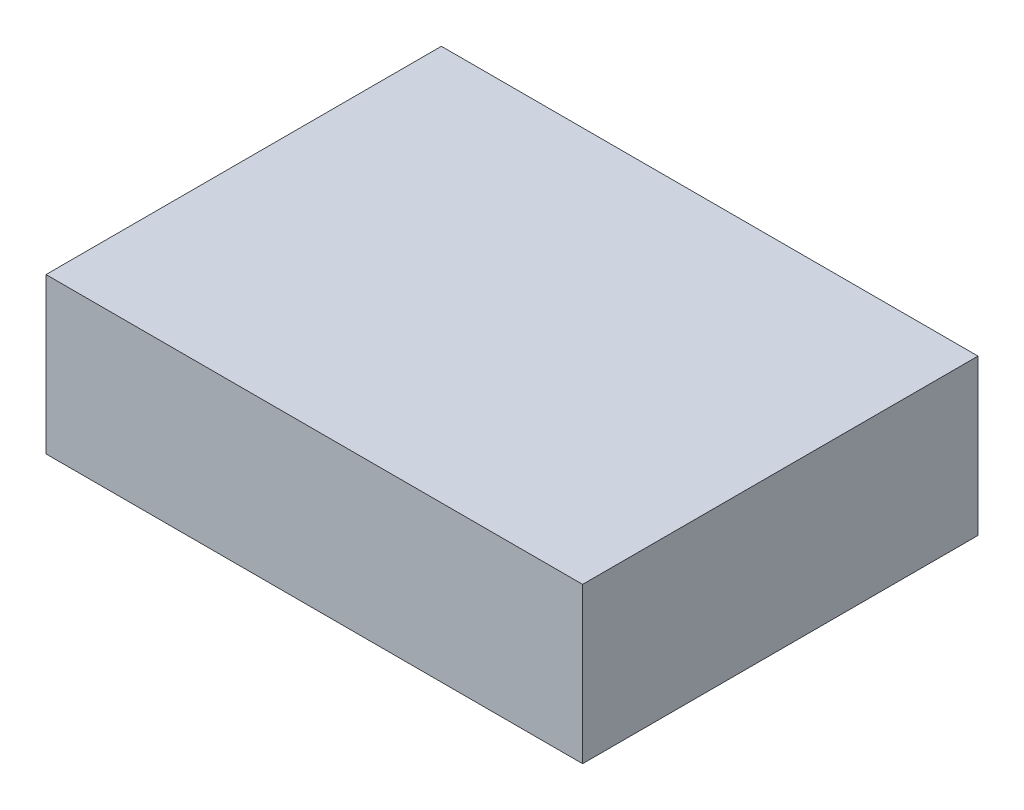
ISO-10303-21;
HEADER;
FILE_DESCRIPTION(('STEP AP214'),'2;1');
FILE_NAME('part.step','',(''),(''),'','','');
FILE_SCHEMA(('AUTOMOTIVE_DESIGN { 1 0 10303 214 1 1 1 1 }'));
ENDSEC;
DATA;
#1=APPLICATION_CONTEXT('core data for automotive mechanical design processes');
#2=APPLICATION_PROTOCOL_DEFINITION('international standard','automotive_design',2000,#1);
#3=PRODUCT_CONTEXT('',#1,'mechanical');
#4=PRODUCT('Part','Part','',(#3));
#5=PRODUCT_RELATED_PRODUCT_CATEGORY('part','',(#4));
#6=PRODUCT_DEFINITION_FORMATION('','',#4);
#7=PRODUCT_DEFINITION_CONTEXT('part definition',#1,'design');
#8=PRODUCT_DEFINITION('design','',#6,#7);
#9=PRODUCT_DEFINITION_SHAPE('','',#8);
#10=(LENGTH_UNIT() NAMED_UNIT(*) SI_UNIT(.MILLI.,.METRE.));
#11=(NAMED_UNIT(*) PLANE_ANGLE_UNIT() SI_UNIT($,.RADIAN.));
#12=(NAMED_UNIT(*) SI_UNIT($,.STERADIAN.) SOLID_ANGLE_UNIT());
#13=UNCERTAINTY_MEASURE_WITH_UNIT(LENGTH_MEASURE(1.E-05),#10,'distance_accuracy_value','');
#14=(GEOMETRIC_REPRESENTATION_CONTEXT(3) GLOBAL_UNCERTAINTY_ASSIGNED_CONTEXT((#13)) GLOBAL_UNIT_ASSIGNED_CONTEXT((#10,
#11,#12)) REPRESENTATION_CONTEXT('',''));
#15=CARTESIAN_POINT('',(0.,0.,0.));
#16=DIRECTION('',(0.,0.,1.));
#17=DIRECTION('',(1.,0.,0.));
#18=AXIS2_PLACEMENT_3D('',#15,#16,#17);
#19=CARTESIAN_POINT('',(475.,275.,350.));
#20=DIRECTION('',(-1.,0.,0.));
#21=DIRECTION('',(0.,0.,1.));
#22=AXIS2_PLACEMENT_3D('',#19,#20,#21);
#23=PLANE('',#22);
#24=DIRECTION('',(0.,0.,-1.));
#25=VECTOR('',#24,1.);
#26=CARTESIAN_POINT('',(475.,0.,350.));
#27=LINE('',#26,#25);
#28=CARTESIAN_POINT('',(475.,0.,350.));
#29=VERTEX_POINT('',#28);
#30=CARTESIAN_POINT('',(475.,0.,-350.));
#31=VERTEX_POINT('',#30);
#32=EDGE_CURVE('E98',#29,#31,#27,.T.);
#33=ORIENTED_EDGE('',*,*,#32,.T.);
#34=DIRECTION('',(0.,-1.,0.));
#35=VECTOR('',#34,1.);
#36=CARTESIAN_POINT('',(475.,275.,-350.));
#37=LINE('',#36,#35);
#38=CARTESIAN_POINT('',(475.,275.,-350.));
#39=VERTEX_POINT('',#38);
#40=EDGE_CURVE('E11',#39,#31,#37,.T.);
#41=ORIENTED_EDGE('',*,*,#40,.F.);
#42=DIRECTION('',(0.,0.,-1.));
#43=VECTOR('',#42,1.);
#44=CARTESIAN_POINT('',(475.,275.,350.));
#45=LINE('',#44,#43);
#46=CARTESIAN_POINT('',(475.,275.,350.));
#47=VERTEX_POINT('',#46);
#48=EDGE_CURVE('E86',#47,#39,#45,.T.);
#49=ORIENTED_EDGE('',*,*,#48,.F.);
#50=DIRECTION('',(0.,-1.,0.));
#51=VECTOR('',#50,1.);
#52=CARTESIAN_POINT('',(475.,275.,350.));
#53=LINE('',#52,#51);
#54=EDGE_CURVE('E94',#47,#29,#53,.T.);
#55=ORIENTED_EDGE('',*,*,#54,.T.);
#56=EDGE_LOOP('',(#33,#41,#49,#55));
#57=FACE_BOUND('',#56,.T.);
#58=ADVANCED_FACE('F35',(#57),#23,.F.);
#59=CARTESIAN_POINT('',(-475.,275.,-350.));
#60=DIRECTION('',(0.,0.,1.));
#61=DIRECTION('',(1.,0.,0.));
#62=AXIS2_PLACEMENT_3D('',#59,#60,#61);
#63=PLANE('',#62);
#64=DIRECTION('',(-1.,0.,0.));
#65=VECTOR('',#64,1.);
#66=CARTESIAN_POINT('',(-475.,0.,-350.));
#67=LINE('',#66,#65);
#68=CARTESIAN_POINT('',(-475.,0.,-350.));
#69=VERTEX_POINT('',#68);
#70=EDGE_CURVE('E90',#31,#69,#67,.T.);
#71=ORIENTED_EDGE('',*,*,#70,.T.);
#72=DIRECTION('',(0.,-1.,0.));
#73=VECTOR('',#72,1.);
#74=CARTESIAN_POINT('',(-475.,275.,-350.));
#75=LINE('',#74,#73);
#76=CARTESIAN_POINT('',(-475.,275.,-350.));
#77=VERTEX_POINT('',#76);
#78=EDGE_CURVE('E43',#77,#69,#75,.T.);
#79=ORIENTED_EDGE('',*,*,#78,.F.);
#80=DIRECTION('',(-1.,0.,0.));
#81=VECTOR('',#80,1.);
#82=CARTESIAN_POINT('',(-475.,275.,-350.));
#83=LINE('',#82,#81);
#84=EDGE_CURVE('E81',#39,#77,#83,.T.);
#85=ORIENTED_EDGE('',*,*,#84,.F.);
#86=ORIENTED_EDGE('',*,*,#40,.T.);
#87=EDGE_LOOP('',(#71,#79,#85,#86));
#88=FACE_BOUND('',#87,.T.);
#89=ADVANCED_FACE('F89',(#88),#63,.F.);
#90=CARTESIAN_POINT('',(-475.,275.,350.));
#91=DIRECTION('',(1.,0.,0.));
#92=DIRECTION('',(0.,0.,-1.));
#93=AXIS2_PLACEMENT_3D('',#90,#91,#92);
#94=PLANE('',#93);
#95=DIRECTION('',(0.,0.,1.));
#96=VECTOR('',#95,1.);
#97=CARTESIAN_POINT('',(-475.,0.,350.));
#98=LINE('',#97,#96);
#99=CARTESIAN_POINT('',(-475.,0.,350.));
#100=VERTEX_POINT('',#99);
#101=EDGE_CURVE('E68',#69,#100,#98,.T.);
#102=ORIENTED_EDGE('',*,*,#101,.T.);
#103=DIRECTION('',(0.,-1.,0.));
#104=VECTOR('',#103,1.);
#105=CARTESIAN_POINT('',(-475.,275.,350.));
#106=LINE('',#105,#104);
#107=CARTESIAN_POINT('',(-475.,275.,350.));
#108=VERTEX_POINT('',#107);
#109=EDGE_CURVE('E91',#108,#100,#106,.T.);
#110=ORIENTED_EDGE('',*,*,#109,.F.);
#111=DIRECTION('',(0.,0.,1.));
#112=VECTOR('',#111,1.);
#113=CARTESIAN_POINT('',(-475.,275.,350.));
#114=LINE('',#113,#112);
#115=EDGE_CURVE('E84',#77,#108,#114,.T.);
#116=ORIENTED_EDGE('',*,*,#115,.F.);
#117=ORIENTED_EDGE('',*,*,#78,.T.);
#118=EDGE_LOOP('',(#102,#110,#116,#117));
#119=FACE_BOUND('',#118,.T.);
#120=ADVANCED_FACE('F92',(#119),#94,.F.);
#121=CARTESIAN_POINT('',(-475.,275.,350.));
#122=DIRECTION('',(0.,0.,-1.));
#123=DIRECTION('',(-1.,0.,0.));
#124=AXIS2_PLACEMENT_3D('',#121,#122,#123);
#125=PLANE('',#124);
#126=DIRECTION('',(1.,0.,0.));
#127=VECTOR('',#126,1.);
#128=CARTESIAN_POINT('',(-475.,0.,350.));
#129=LINE('',#128,#127);
#130=EDGE_CURVE('E74',#100,#29,#129,.T.);
#131=ORIENTED_EDGE('',*,*,#130,.T.);
#132=ORIENTED_EDGE('',*,*,#54,.F.);
#133=DIRECTION('',(1.,0.,0.));
#134=VECTOR('',#133,1.);
#135=CARTESIAN_POINT('',(-475.,275.,350.));
#136=LINE('',#135,#134);
#137=EDGE_CURVE('E51',#108,#47,#136,.T.);
#138=ORIENTED_EDGE('',*,*,#137,.F.);
#139=ORIENTED_EDGE('',*,*,#109,.T.);
#140=EDGE_LOOP('',(#131,#132,#138,#139));
#141=FACE_BOUND('',#140,.T.);
#142=ADVANCED_FACE('F105',(#141),#125,.F.);
#143=CARTESIAN_POINT('',(0.,275.,0.));
#144=DIRECTION('',(0.,-1.,0.));
#145=DIRECTION('',(0.,0.,-1.));
#146=AXIS2_PLACEMENT_3D('',#143,#144,#145);
#147=PLANE('',#146);
#148=ORIENTED_EDGE('',*,*,#48,.T.);
#149=ORIENTED_EDGE('',*,*,#84,.T.);
#150=ORIENTED_EDGE('',*,*,#115,.T.);
#151=ORIENTED_EDGE('',*,*,#137,.T.);
#152=EDGE_LOOP('',(#148,#149,#150,#151));
#153=FACE_BOUND('',#152,.T.);
#154=ADVANCED_FACE('F82',(#153),#147,.F.);
#155=CARTESIAN_POINT('',(0.,0.,0.));
#156=DIRECTION('',(0.,-1.,0.));
#157=DIRECTION('',(0.,0.,-1.));
#158=AXIS2_PLACEMENT_3D('',#155,#156,#157);
#159=PLANE('',#158);
#160=ORIENTED_EDGE('',*,*,#32,.F.);
#161=ORIENTED_EDGE('',*,*,#130,.F.);
#162=ORIENTED_EDGE('',*,*,#101,.F.);
#163=ORIENTED_EDGE('',*,*,#70,.F.);
#164=EDGE_LOOP('',(#160,#161,#162,#163));
#165=FACE_BOUND('',#164,.T.);
#166=ADVANCED_FACE('F108',(#165),#159,.T.);
#167=CLOSED_SHELL('',(#58,#89,#120,#142,#154,#166));
#168=MANIFOLD_SOLID_BREP('B2',#167);
#169=ADVANCED_BREP_SHAPE_REPRESENTATION('',(#18,#168),#14);
#170=SHAPE_DEFINITION_REPRESENTATION(#9,#169);
ENDSEC;
END-ISO-10303-21;
